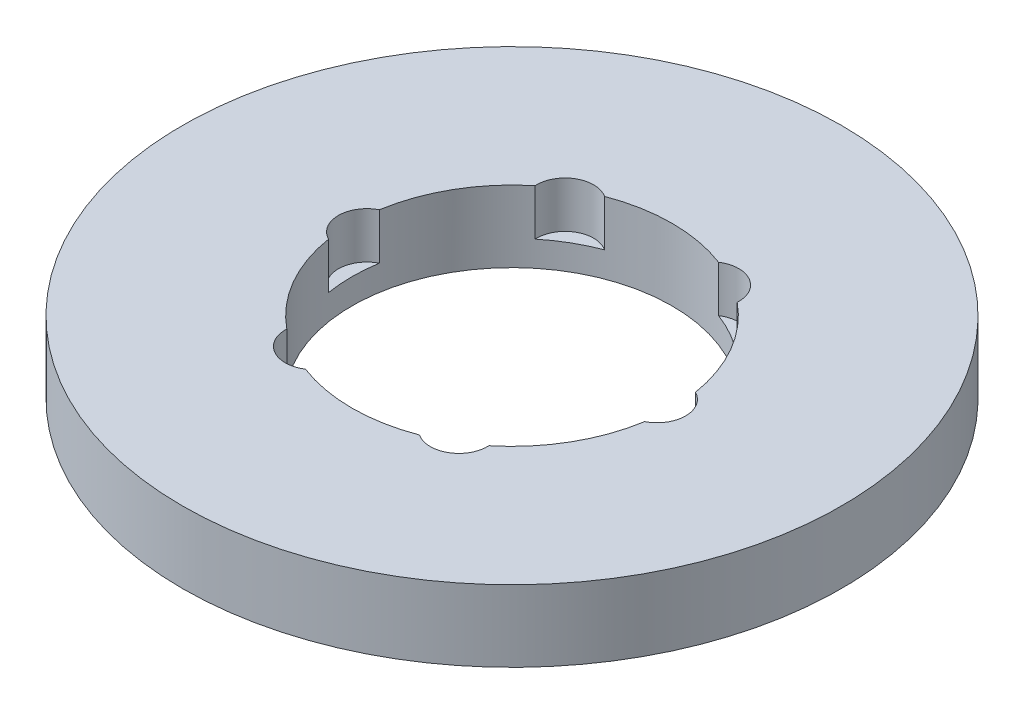
ISO-10303-21;
HEADER;
FILE_DESCRIPTION(('STEP AP214'),'2;1');
FILE_NAME('part.step','',(''),(''),'','','');
FILE_SCHEMA(('AUTOMOTIVE_DESIGN { 1 0 10303 214 1 1 1 1 }'));
ENDSEC;
DATA;
#1=APPLICATION_CONTEXT('core data for automotive mechanical design processes');
#2=APPLICATION_PROTOCOL_DEFINITION('international standard','automotive_design',2000,#1);
#3=PRODUCT_CONTEXT('',#1,'mechanical');
#4=PRODUCT('Part','Part','',(#3));
#5=PRODUCT_RELATED_PRODUCT_CATEGORY('part','',(#4));
#6=PRODUCT_DEFINITION_FORMATION('','',#4);
#7=PRODUCT_DEFINITION_CONTEXT('part definition',#1,'design');
#8=PRODUCT_DEFINITION('design','',#6,#7);
#9=PRODUCT_DEFINITION_SHAPE('','',#8);
#10=(LENGTH_UNIT() NAMED_UNIT(*) SI_UNIT(.MILLI.,.METRE.));
#11=(NAMED_UNIT(*) PLANE_ANGLE_UNIT() SI_UNIT($,.RADIAN.));
#12=(NAMED_UNIT(*) SI_UNIT($,.STERADIAN.) SOLID_ANGLE_UNIT());
#13=UNCERTAINTY_MEASURE_WITH_UNIT(LENGTH_MEASURE(1.E-05),#10,'distance_accuracy_value','');
#14=(GEOMETRIC_REPRESENTATION_CONTEXT(3) GLOBAL_UNCERTAINTY_ASSIGNED_CONTEXT((#13)) GLOBAL_UNIT_ASSIGNED_CONTEXT((#10,
#11,#12)) REPRESENTATION_CONTEXT('',''));
#15=CARTESIAN_POINT('',(0.,0.,0.));
#16=DIRECTION('',(0.,0.,1.));
#17=DIRECTION('',(1.,0.,0.));
#18=AXIS2_PLACEMENT_3D('',#15,#16,#17);
#19=CARTESIAN_POINT('',(0.,19.,0.));
#20=DIRECTION('',(0.,-1.,0.));
#21=DIRECTION('',(0.,0.,-1.));
#22=AXIS2_PLACEMENT_3D('',#19,#20,#21);
#23=CYLINDRICAL_SURFACE('',#22,87.5);
#24=CARTESIAN_POINT('',(0.,19.,0.));
#25=DIRECTION('',(0.,1.,0.));
#26=DIRECTION('',(0.,0.,1.));
#27=AXIS2_PLACEMENT_3D('',#24,#25,#26);
#28=CIRCLE('',#27,87.5);
#29=CARTESIAN_POINT('',(0.,19.,87.5));
#30=VERTEX_POINT('',#29);
#31=EDGE_CURVE('E162',#30,#30,#28,.T.);
#32=ORIENTED_EDGE('',*,*,#31,.F.);
#33=EDGE_LOOP('',(#32));
#34=FACE_BOUND('',#33,.T.);
#35=CARTESIAN_POINT('',(0.,0.,0.));
#36=DIRECTION('',(0.,1.,0.));
#37=DIRECTION('',(0.,0.,1.));
#38=AXIS2_PLACEMENT_3D('',#35,#36,#37);
#39=CIRCLE('',#38,87.5);
#40=CARTESIAN_POINT('',(0.,0.,87.5));
#41=VERTEX_POINT('',#40);
#42=EDGE_CURVE('E157',#41,#41,#39,.T.);
#43=ORIENTED_EDGE('',*,*,#42,.T.);
#44=EDGE_LOOP('',(#43));
#45=FACE_BOUND('',#44,.T.);
#46=ADVANCED_FACE('F39',(#34,#45),#23,.T.);
#47=CARTESIAN_POINT('',(0.,19.,0.));
#48=DIRECTION('',(0.,1.,0.));
#49=DIRECTION('',(0.,0.,1.));
#50=AXIS2_PLACEMENT_3D('',#47,#48,#49);
#51=PLANE('',#50);
#52=CARTESIAN_POINT('',(-19.2661317388735,19.,-33.3699190370433));
#53=DIRECTION('',(0.,1.,0.));
#54=DIRECTION('',(-0.866025403784433,0.,0.50000000000001));
#55=AXIS2_PLACEMENT_3D('',#52,#53,#54);
#56=CIRCLE('',#55,7.5710354546421);
#57=CARTESIAN_POINT('',(-15.1342240727539,19.,-39.714043633401));
#58=VERTEX_POINT('',#57);
#59=CARTESIAN_POINT('',(-26.8262586371527,19.,-32.9636443302708));
#60=VERTEX_POINT('',#59);
#61=EDGE_CURVE('E218',#58,#60,#56,.T.);
#62=ORIENTED_EDGE('',*,*,#61,.F.);
#63=CARTESIAN_POINT('',(0.,19.,0.));
#64=DIRECTION('',(0.,1.,0.));
#65=DIRECTION('',(0.,0.,1.));
#66=AXIS2_PLACEMENT_3D('',#63,#64,#65);
#67=CIRCLE('',#66,42.5);
#68=CARTESIAN_POINT('',(15.1342240727531,19.,-39.7140436334013));
#69=VERTEX_POINT('',#68);
#70=EDGE_CURVE('E169',#69,#58,#67,.T.);
#71=ORIENTED_EDGE('',*,*,#70,.F.);
#72=CARTESIAN_POINT('',(19.2661317388728,19.,-33.3699190370437));
#73=DIRECTION('',(0.,1.,0.));
#74=DIRECTION('',(-0.866025403784443,0.,-0.499999999999992));
#75=AXIS2_PLACEMENT_3D('',#72,#73,#74);
#76=CIRCLE('',#75,7.5710354546421);
#77=CARTESIAN_POINT('',(26.826258637152,19.,-32.9636443302713));
#78=VERTEX_POINT('',#77);
#79=EDGE_CURVE('E285',#78,#69,#76,.T.);
#80=ORIENTED_EDGE('',*,*,#79,.F.);
#81=CARTESIAN_POINT('',(41.9604827099058,19.,-6.75039930313007));
#82=VERTEX_POINT('',#81);
#83=EDGE_CURVE('E174',#82,#78,#67,.T.);
#84=ORIENTED_EDGE('',*,*,#83,.F.);
#85=CARTESIAN_POINT('',(38.5322634777462,19.,0.));
#86=DIRECTION('',(0.,1.,0.));
#87=DIRECTION('',(0.,0.,-1.));
#88=AXIS2_PLACEMENT_3D('',#85,#86,#87);
#89=CIRCLE('',#88,7.5710354546421);
#90=CARTESIAN_POINT('',(41.9604827099058,19.,6.75039930313007));
#91=VERTEX_POINT('',#90);
#92=EDGE_CURVE('E280',#91,#82,#89,.T.);
#93=ORIENTED_EDGE('',*,*,#92,.F.);
#94=CARTESIAN_POINT('',(26.8262586371525,19.,32.963644330271));
#95=VERTEX_POINT('',#94);
#96=EDGE_CURVE('E164',#95,#91,#67,.T.);
#97=ORIENTED_EDGE('',*,*,#96,.F.);
#98=CARTESIAN_POINT('',(19.2661317388733,19.,33.3699190370435));
#99=DIRECTION('',(0.,1.,0.));
#100=DIRECTION('',(0.866025403784436,0.,-0.500000000000004));
#101=AXIS2_PLACEMENT_3D('',#98,#99,#100);
#102=CIRCLE('',#101,7.5710354546421);
#103=CARTESIAN_POINT('',(15.1342240727537,19.,39.7140436334011));
#104=VERTEX_POINT('',#103);
#105=EDGE_CURVE('E269',#104,#95,#102,.T.);
#106=ORIENTED_EDGE('',*,*,#105,.F.);
#107=CARTESIAN_POINT('',(-15.1342240727534,19.,39.7140436334012));
#108=VERTEX_POINT('',#107);
#109=EDGE_CURVE('E149',#108,#104,#67,.T.);
#110=ORIENTED_EDGE('',*,*,#109,.F.);
#111=CARTESIAN_POINT('',(-19.266131738873,19.,33.3699190370436));
#112=DIRECTION('',(0.,1.,0.));
#113=DIRECTION('',(0.86602540378444,0.,0.499999999999998));
#114=AXIS2_PLACEMENT_3D('',#111,#112,#113);
#115=CIRCLE('',#114,7.5710354546421);
#116=CARTESIAN_POINT('',(-26.8262586371522,19.,32.9636443302711));
#117=VERTEX_POINT('',#116);
#118=EDGE_CURVE('E128',#117,#108,#115,.T.);
#119=ORIENTED_EDGE('',*,*,#118,.F.);
#120=CARTESIAN_POINT('',(-41.9604827099058,19.,6.75039930313007));
#121=VERTEX_POINT('',#120);
#122=EDGE_CURVE('E148',#121,#117,#67,.T.);
#123=ORIENTED_EDGE('',*,*,#122,.F.);
#124=CARTESIAN_POINT('',(-38.5322634777462,19.,0.));
#125=DIRECTION('',(0.,1.,0.));
#126=DIRECTION('',(0.,0.,1.));
#127=AXIS2_PLACEMENT_3D('',#124,#125,#126);
#128=CIRCLE('',#127,7.5710354546421);
#129=CARTESIAN_POINT('',(-41.9604827099058,19.,-6.75039930313007));
#130=VERTEX_POINT('',#129);
#131=EDGE_CURVE('E179',#130,#121,#128,.T.);
#132=ORIENTED_EDGE('',*,*,#131,.F.);
#133=EDGE_CURVE('E161',#60,#130,#67,.T.);
#134=ORIENTED_EDGE('',*,*,#133,.F.);
#135=EDGE_LOOP('',(#62,#71,#80,#84,#93,#97,#106,#110,#119,#123,#132,#134));
#136=FACE_BOUND('',#135,.T.);
#137=ORIENTED_EDGE('',*,*,#31,.T.);
#138=EDGE_LOOP('',(#137));
#139=FACE_BOUND('',#138,.T.);
#140=ADVANCED_FACE('F141',(#136,#139),#51,.T.);
#141=CARTESIAN_POINT('',(0.,0.,0.));
#142=DIRECTION('',(0.,1.,0.));
#143=DIRECTION('',(0.,0.,1.));
#144=AXIS2_PLACEMENT_3D('',#141,#142,#143);
#145=PLANE('',#144);
#146=CARTESIAN_POINT('',(0.,0.,0.));
#147=DIRECTION('',(0.,1.,0.));
#148=DIRECTION('',(0.,0.,1.));
#149=AXIS2_PLACEMENT_3D('',#146,#147,#148);
#150=CIRCLE('',#149,42.5);
#151=CARTESIAN_POINT('',(0.,0.,42.5));
#152=VERTEX_POINT('',#151);
#153=EDGE_CURVE('E166',#152,#152,#150,.T.);
#154=ORIENTED_EDGE('',*,*,#153,.T.);
#155=EDGE_LOOP('',(#154));
#156=FACE_BOUND('',#155,.T.);
#157=ORIENTED_EDGE('',*,*,#42,.F.);
#158=EDGE_LOOP('',(#157));
#159=FACE_BOUND('',#158,.T.);
#160=ADVANCED_FACE('F234',(#156,#159),#145,.F.);
#161=CARTESIAN_POINT('',(0.,19.,0.));
#162=DIRECTION('',(0.,-1.,0.));
#163=DIRECTION('',(0.,0.,-1.));
#164=AXIS2_PLACEMENT_3D('',#161,#162,#163);
#165=CYLINDRICAL_SURFACE('',#164,42.5);
#166=DIRECTION('',(0.,1.,0.));
#167=VECTOR('',#166,1.);
#168=CARTESIAN_POINT('',(-15.1342240727539,12.8593762244336,-39.714043633401));
#169=LINE('',#168,#167);
#170=CARTESIAN_POINT('',(-15.1342240727539,6.71875244886714,-39.714043633401));
#171=VERTEX_POINT('',#170);
#172=EDGE_CURVE('E11',#171,#58,#169,.T.);
#173=ORIENTED_EDGE('',*,*,#172,.F.);
#174=CARTESIAN_POINT('',(0.,6.71875244886714,0.));
#175=DIRECTION('',(0.,1.,0.));
#176=DIRECTION('',(0.,0.,1.));
#177=AXIS2_PLACEMENT_3D('',#174,#175,#176);
#178=CIRCLE('',#177,42.5);
#179=CARTESIAN_POINT('',(-26.8262586371527,6.71875244886714,-32.9636443302708));
#180=VERTEX_POINT('',#179);
#181=EDGE_CURVE('E214',#171,#180,#178,.T.);
#182=ORIENTED_EDGE('',*,*,#181,.T.);
#183=DIRECTION('',(0.,1.,0.));
#184=VECTOR('',#183,1.);
#185=CARTESIAN_POINT('',(-26.8262586371527,12.8593762244336,-32.9636443302708));
#186=LINE('',#185,#184);
#187=EDGE_CURVE('E46',#60,#180,#186,.F.);
#188=ORIENTED_EDGE('',*,*,#187,.F.);
#189=ORIENTED_EDGE('',*,*,#133,.T.);
#190=DIRECTION('',(0.,1.,0.));
#191=VECTOR('',#190,1.);
#192=CARTESIAN_POINT('',(-41.9604827099058,12.8593762244336,-6.75039930313007));
#193=LINE('',#192,#191);
#194=CARTESIAN_POINT('',(-41.9604827099058,6.71875244886714,-6.75039930313007));
#195=VERTEX_POINT('',#194);
#196=EDGE_CURVE('E187',#195,#130,#193,.T.);
#197=ORIENTED_EDGE('',*,*,#196,.F.);
#198=CARTESIAN_POINT('',(0.,6.71875244886714,0.));
#199=DIRECTION('',(0.,1.,0.));
#200=DIRECTION('',(0.,0.,1.));
#201=AXIS2_PLACEMENT_3D('',#198,#199,#200);
#202=CIRCLE('',#201,42.5);
#203=CARTESIAN_POINT('',(-41.9604827099058,6.71875244886714,6.75039930313007));
#204=VERTEX_POINT('',#203);
#205=EDGE_CURVE('E184',#195,#204,#202,.T.);
#206=ORIENTED_EDGE('',*,*,#205,.T.);
#207=DIRECTION('',(0.,1.,0.));
#208=VECTOR('',#207,1.);
#209=CARTESIAN_POINT('',(-41.9604827099058,12.8593762244336,6.75039930313007));
#210=LINE('',#209,#208);
#211=EDGE_CURVE('E158',#121,#204,#210,.F.);
#212=ORIENTED_EDGE('',*,*,#211,.F.);
#213=ORIENTED_EDGE('',*,*,#122,.T.);
#214=DIRECTION('',(0.,1.,0.));
#215=VECTOR('',#214,1.);
#216=CARTESIAN_POINT('',(-26.8262586371522,12.8593762244336,32.9636443302711));
#217=LINE('',#216,#215);
#218=CARTESIAN_POINT('',(-26.8262586371522,6.71875244886714,32.9636443302711));
#219=VERTEX_POINT('',#218);
#220=EDGE_CURVE('E127',#219,#117,#217,.T.);
#221=ORIENTED_EDGE('',*,*,#220,.F.);
#222=CARTESIAN_POINT('',(0.,6.71875244886714,0.));
#223=DIRECTION('',(0.,1.,0.));
#224=DIRECTION('',(0.,0.,1.));
#225=AXIS2_PLACEMENT_3D('',#222,#223,#224);
#226=CIRCLE('',#225,42.5);
#227=CARTESIAN_POINT('',(-15.1342240727534,6.71875244886714,39.7140436334012));
#228=VERTEX_POINT('',#227);
#229=EDGE_CURVE('E189',#219,#228,#226,.T.);
#230=ORIENTED_EDGE('',*,*,#229,.T.);
#231=DIRECTION('',(0.,1.,0.));
#232=VECTOR('',#231,1.);
#233=CARTESIAN_POINT('',(-15.1342240727534,12.8593762244336,39.7140436334012));
#234=LINE('',#233,#232);
#235=EDGE_CURVE('E140',#108,#228,#234,.F.);
#236=ORIENTED_EDGE('',*,*,#235,.F.);
#237=ORIENTED_EDGE('',*,*,#109,.T.);
#238=DIRECTION('',(0.,1.,0.));
#239=VECTOR('',#238,1.);
#240=CARTESIAN_POINT('',(15.1342240727537,12.8593762244336,39.7140436334011));
#241=LINE('',#240,#239);
#242=CARTESIAN_POINT('',(15.1342240727537,6.71875244886714,39.7140436334011));
#243=VERTEX_POINT('',#242);
#244=EDGE_CURVE('E196',#243,#104,#241,.T.);
#245=ORIENTED_EDGE('',*,*,#244,.F.);
#246=CARTESIAN_POINT('',(0.,6.71875244886714,0.));
#247=DIRECTION('',(0.,1.,0.));
#248=DIRECTION('',(0.,0.,1.));
#249=AXIS2_PLACEMENT_3D('',#246,#247,#248);
#250=CIRCLE('',#249,42.5);
#251=CARTESIAN_POINT('',(26.8262586371525,6.71875244886714,32.963644330271));
#252=VERTEX_POINT('',#251);
#253=EDGE_CURVE('E136',#243,#252,#250,.T.);
#254=ORIENTED_EDGE('',*,*,#253,.T.);
#255=DIRECTION('',(0.,1.,0.));
#256=VECTOR('',#255,1.);
#257=CARTESIAN_POINT('',(26.8262586371525,12.8593762244336,32.963644330271));
#258=LINE('',#257,#256);
#259=EDGE_CURVE('E194',#95,#252,#258,.F.);
#260=ORIENTED_EDGE('',*,*,#259,.F.);
#261=ORIENTED_EDGE('',*,*,#96,.T.);
#262=DIRECTION('',(0.,1.,0.));
#263=VECTOR('',#262,1.);
#264=CARTESIAN_POINT('',(41.9604827099058,12.8593762244336,6.75039930313007));
#265=LINE('',#264,#263);
#266=CARTESIAN_POINT('',(41.9604827099058,6.71875244886714,6.75039930313007));
#267=VERTEX_POINT('',#266);
#268=EDGE_CURVE('E206',#267,#91,#265,.T.);
#269=ORIENTED_EDGE('',*,*,#268,.F.);
#270=CARTESIAN_POINT('',(0.,6.71875244886714,0.));
#271=DIRECTION('',(0.,1.,0.));
#272=DIRECTION('',(0.,0.,1.));
#273=AXIS2_PLACEMENT_3D('',#270,#271,#272);
#274=CIRCLE('',#273,42.5);
#275=CARTESIAN_POINT('',(41.9604827099058,6.71875244886714,-6.75039930313007));
#276=VERTEX_POINT('',#275);
#277=EDGE_CURVE('E199',#267,#276,#274,.T.);
#278=ORIENTED_EDGE('',*,*,#277,.T.);
#279=DIRECTION('',(0.,1.,0.));
#280=VECTOR('',#279,1.);
#281=CARTESIAN_POINT('',(41.9604827099058,12.8593762244336,-6.75039930313007));
#282=LINE('',#281,#280);
#283=EDGE_CURVE('E201',#82,#276,#282,.F.);
#284=ORIENTED_EDGE('',*,*,#283,.F.);
#285=ORIENTED_EDGE('',*,*,#83,.T.);
#286=DIRECTION('',(0.,1.,0.));
#287=VECTOR('',#286,1.);
#288=CARTESIAN_POINT('',(26.826258637152,12.8593762244336,-32.9636443302713));
#289=LINE('',#288,#287);
#290=CARTESIAN_POINT('',(26.826258637152,6.71875244886714,-32.9636443302713));
#291=VERTEX_POINT('',#290);
#292=EDGE_CURVE('E213',#291,#78,#289,.T.);
#293=ORIENTED_EDGE('',*,*,#292,.F.);
#294=CARTESIAN_POINT('',(0.,6.71875244886714,0.));
#295=DIRECTION('',(0.,1.,0.));
#296=DIRECTION('',(0.,0.,1.));
#297=AXIS2_PLACEMENT_3D('',#294,#295,#296);
#298=CIRCLE('',#297,42.5);
#299=CARTESIAN_POINT('',(15.1342240727531,6.71875244886714,-39.7140436334013));
#300=VERTEX_POINT('',#299);
#301=EDGE_CURVE('E208',#291,#300,#298,.T.);
#302=ORIENTED_EDGE('',*,*,#301,.T.);
#303=DIRECTION('',(0.,1.,0.));
#304=VECTOR('',#303,1.);
#305=CARTESIAN_POINT('',(15.1342240727531,12.8593762244336,-39.7140436334013));
#306=LINE('',#305,#304);
#307=EDGE_CURVE('E211',#69,#300,#306,.F.);
#308=ORIENTED_EDGE('',*,*,#307,.F.);
#309=ORIENTED_EDGE('',*,*,#70,.T.);
#310=EDGE_LOOP('',(#173,#182,#188,#189,#197,#206,#212,#213,#221,#230,#236,#237,#245,#254,#260,
#261,#269,#278,#284,#285,#293,#302,#308,#309));
#311=FACE_BOUND('',#310,.T.);
#312=ORIENTED_EDGE('',*,*,#153,.F.);
#313=EDGE_LOOP('',(#312));
#314=FACE_BOUND('',#313,.T.);
#315=ADVANCED_FACE('F152',(#311,#314),#165,.F.);
#316=CARTESIAN_POINT('',(-38.5322634777462,6.71875244886714,0.));
#317=DIRECTION('',(0.,1.,0.));
#318=DIRECTION('',(0.,0.,1.));
#319=AXIS2_PLACEMENT_3D('',#316,#317,#318);
#320=CYLINDRICAL_SURFACE('',#319,7.5710354546421);
#321=ORIENTED_EDGE('',*,*,#196,.T.);
#322=ORIENTED_EDGE('',*,*,#131,.T.);
#323=ORIENTED_EDGE('',*,*,#211,.T.);
#324=CARTESIAN_POINT('',(-38.5322634777462,6.71875244886714,0.));
#325=DIRECTION('',(0.,1.,0.));
#326=DIRECTION('',(0.,0.,1.));
#327=AXIS2_PLACEMENT_3D('',#324,#325,#326);
#328=CIRCLE('',#327,7.5710354546421);
#329=EDGE_CURVE('E180',#195,#204,#328,.T.);
#330=ORIENTED_EDGE('',*,*,#329,.F.);
#331=EDGE_LOOP('',(#321,#322,#323,#330));
#332=FACE_BOUND('',#331,.T.);
#333=ADVANCED_FACE('F244',(#332),#320,.F.);
#334=CARTESIAN_POINT('',(-38.5322634777462,6.71875244886714,0.));
#335=DIRECTION('',(0.,1.,0.));
#336=DIRECTION('',(0.,0.,1.));
#337=AXIS2_PLACEMENT_3D('',#334,#335,#336);
#338=PLANE('',#337);
#339=ORIENTED_EDGE('',*,*,#329,.T.);
#340=ORIENTED_EDGE('',*,*,#205,.F.);
#341=EDGE_LOOP('',(#339,#340));
#342=FACE_BOUND('',#341,.T.);
#343=ADVANCED_FACE('F248',(#342),#338,.T.);
#344=CARTESIAN_POINT('',(-19.266131738873,6.71875244886714,33.3699190370436));
#345=DIRECTION('',(0.,1.,0.));
#346=DIRECTION('',(0.,0.,1.));
#347=AXIS2_PLACEMENT_3D('',#344,#345,#346);
#348=CYLINDRICAL_SURFACE('',#347,7.5710354546421);
#349=ORIENTED_EDGE('',*,*,#220,.T.);
#350=ORIENTED_EDGE('',*,*,#118,.T.);
#351=ORIENTED_EDGE('',*,*,#235,.T.);
#352=CARTESIAN_POINT('',(-19.266131738873,6.71875244886714,33.3699190370436));
#353=DIRECTION('',(0.,1.,0.));
#354=DIRECTION('',(0.86602540378444,0.,0.499999999999998));
#355=AXIS2_PLACEMENT_3D('',#352,#353,#354);
#356=CIRCLE('',#355,7.5710354546421);
#357=EDGE_CURVE('E135',#219,#228,#356,.T.);
#358=ORIENTED_EDGE('',*,*,#357,.F.);
#359=EDGE_LOOP('',(#349,#350,#351,#358));
#360=FACE_BOUND('',#359,.T.);
#361=ADVANCED_FACE('F126',(#360),#348,.F.);
#362=CARTESIAN_POINT('',(-19.266131738873,6.71875244886714,33.3699190370436));
#363=DIRECTION('',(0.,1.,0.));
#364=DIRECTION('',(0.86602540378444,0.,0.499999999999998));
#365=AXIS2_PLACEMENT_3D('',#362,#363,#364);
#366=PLANE('',#365);
#367=ORIENTED_EDGE('',*,*,#357,.T.);
#368=ORIENTED_EDGE('',*,*,#229,.F.);
#369=EDGE_LOOP('',(#367,#368));
#370=FACE_BOUND('',#369,.T.);
#371=ADVANCED_FACE('F258',(#370),#366,.T.);
#372=CARTESIAN_POINT('',(19.2661317388733,6.71875244886714,33.3699190370435));
#373=DIRECTION('',(0.,1.,0.));
#374=DIRECTION('',(0.,0.,1.));
#375=AXIS2_PLACEMENT_3D('',#372,#373,#374);
#376=CYLINDRICAL_SURFACE('',#375,7.5710354546421);
#377=ORIENTED_EDGE('',*,*,#244,.T.);
#378=ORIENTED_EDGE('',*,*,#105,.T.);
#379=ORIENTED_EDGE('',*,*,#259,.T.);
#380=CARTESIAN_POINT('',(19.2661317388733,6.71875244886714,33.3699190370435));
#381=DIRECTION('',(0.,1.,0.));
#382=DIRECTION('',(0.866025403784436,0.,-0.500000000000004));
#383=AXIS2_PLACEMENT_3D('',#380,#381,#382);
#384=CIRCLE('',#383,7.5710354546421);
#385=EDGE_CURVE('E147',#243,#252,#384,.T.);
#386=ORIENTED_EDGE('',*,*,#385,.F.);
#387=EDGE_LOOP('',(#377,#378,#379,#386));
#388=FACE_BOUND('',#387,.T.);
#389=ADVANCED_FACE('F256',(#388),#376,.F.);
#390=CARTESIAN_POINT('',(19.2661317388733,6.71875244886714,33.3699190370435));
#391=DIRECTION('',(0.,1.,0.));
#392=DIRECTION('',(0.866025403784436,0.,-0.500000000000004));
#393=AXIS2_PLACEMENT_3D('',#390,#391,#392);
#394=PLANE('',#393);
#395=ORIENTED_EDGE('',*,*,#385,.T.);
#396=ORIENTED_EDGE('',*,*,#253,.F.);
#397=EDGE_LOOP('',(#395,#396));
#398=FACE_BOUND('',#397,.T.);
#399=ADVANCED_FACE('F263',(#398),#394,.T.);
#400=CARTESIAN_POINT('',(38.5322634777462,6.71875244886714,0.));
#401=DIRECTION('',(0.,1.,0.));
#402=DIRECTION('',(0.,0.,1.));
#403=AXIS2_PLACEMENT_3D('',#400,#401,#402);
#404=CYLINDRICAL_SURFACE('',#403,7.5710354546421);
#405=ORIENTED_EDGE('',*,*,#268,.T.);
#406=ORIENTED_EDGE('',*,*,#92,.T.);
#407=ORIENTED_EDGE('',*,*,#283,.T.);
#408=CARTESIAN_POINT('',(38.5322634777462,6.71875244886714,0.));
#409=DIRECTION('',(0.,1.,0.));
#410=DIRECTION('',(0.,0.,-1.));
#411=AXIS2_PLACEMENT_3D('',#408,#409,#410);
#412=CIRCLE('',#411,7.5710354546421);
#413=EDGE_CURVE('E273',#267,#276,#412,.T.);
#414=ORIENTED_EDGE('',*,*,#413,.F.);
#415=EDGE_LOOP('',(#405,#406,#407,#414));
#416=FACE_BOUND('',#415,.T.);
#417=ADVANCED_FACE('F297',(#416),#404,.F.);
#418=CARTESIAN_POINT('',(38.5322634777462,6.71875244886714,0.));
#419=DIRECTION('',(0.,1.,0.));
#420=DIRECTION('',(0.,0.,-1.));
#421=AXIS2_PLACEMENT_3D('',#418,#419,#420);
#422=PLANE('',#421);
#423=ORIENTED_EDGE('',*,*,#413,.T.);
#424=ORIENTED_EDGE('',*,*,#277,.F.);
#425=EDGE_LOOP('',(#423,#424));
#426=FACE_BOUND('',#425,.T.);
#427=ADVANCED_FACE('F299',(#426),#422,.T.);
#428=CARTESIAN_POINT('',(19.2661317388728,6.71875244886714,-33.3699190370437));
#429=DIRECTION('',(0.,1.,0.));
#430=DIRECTION('',(0.,0.,1.));
#431=AXIS2_PLACEMENT_3D('',#428,#429,#430);
#432=CYLINDRICAL_SURFACE('',#431,7.5710354546421);
#433=ORIENTED_EDGE('',*,*,#292,.T.);
#434=ORIENTED_EDGE('',*,*,#79,.T.);
#435=ORIENTED_EDGE('',*,*,#307,.T.);
#436=CARTESIAN_POINT('',(19.2661317388728,6.71875244886714,-33.3699190370437));
#437=DIRECTION('',(0.,1.,0.));
#438=DIRECTION('',(-0.866025403784443,0.,-0.499999999999992));
#439=AXIS2_PLACEMENT_3D('',#436,#437,#438);
#440=CIRCLE('',#439,7.5710354546421);
#441=EDGE_CURVE('E56',#291,#300,#440,.T.);
#442=ORIENTED_EDGE('',*,*,#441,.F.);
#443=EDGE_LOOP('',(#433,#434,#435,#442));
#444=FACE_BOUND('',#443,.T.);
#445=ADVANCED_FACE('F292',(#444),#432,.F.);
#446=CARTESIAN_POINT('',(19.2661317388728,6.71875244886714,-33.3699190370437));
#447=DIRECTION('',(0.,1.,0.));
#448=DIRECTION('',(-0.866025403784443,0.,-0.499999999999992));
#449=AXIS2_PLACEMENT_3D('',#446,#447,#448);
#450=PLANE('',#449);
#451=ORIENTED_EDGE('',*,*,#441,.T.);
#452=ORIENTED_EDGE('',*,*,#301,.F.);
#453=EDGE_LOOP('',(#451,#452));
#454=FACE_BOUND('',#453,.T.);
#455=ADVANCED_FACE('F226',(#454),#450,.T.);
#456=CARTESIAN_POINT('',(-19.2661317388735,6.71875244886714,-33.3699190370433));
#457=DIRECTION('',(0.,1.,0.));
#458=DIRECTION('',(0.,0.,1.));
#459=AXIS2_PLACEMENT_3D('',#456,#457,#458);
#460=CYLINDRICAL_SURFACE('',#459,7.5710354546421);
#461=ORIENTED_EDGE('',*,*,#172,.T.);
#462=ORIENTED_EDGE('',*,*,#61,.T.);
#463=ORIENTED_EDGE('',*,*,#187,.T.);
#464=CARTESIAN_POINT('',(-19.2661317388735,6.71875244886714,-33.3699190370433));
#465=DIRECTION('',(0.,1.,0.));
#466=DIRECTION('',(-0.866025403784433,0.,0.50000000000001));
#467=AXIS2_PLACEMENT_3D('',#464,#465,#466);
#468=CIRCLE('',#467,7.5710354546421);
#469=EDGE_CURVE('E55',#171,#180,#468,.T.);
#470=ORIENTED_EDGE('',*,*,#469,.F.);
#471=EDGE_LOOP('',(#461,#462,#463,#470));
#472=FACE_BOUND('',#471,.T.);
#473=ADVANCED_FACE('F217',(#472),#460,.F.);
#474=CARTESIAN_POINT('',(-19.2661317388735,6.71875244886714,-33.3699190370433));
#475=DIRECTION('',(0.,1.,0.));
#476=DIRECTION('',(-0.866025403784433,0.,0.50000000000001));
#477=AXIS2_PLACEMENT_3D('',#474,#475,#476);
#478=PLANE('',#477);
#479=ORIENTED_EDGE('',*,*,#469,.T.);
#480=ORIENTED_EDGE('',*,*,#181,.F.);
#481=EDGE_LOOP('',(#479,#480));
#482=FACE_BOUND('',#481,.T.);
#483=ADVANCED_FACE('F219',(#482),#478,.T.);
#484=CLOSED_SHELL('',(#46,#140,#160,#315,#333,#343,#361,#371,#389,#399,#417,#427,#445,#455,#473,#483));
#485=MANIFOLD_SOLID_BREP('B2',#484);
#486=ADVANCED_BREP_SHAPE_REPRESENTATION('',(#18,#485),#14);
#487=SHAPE_DEFINITION_REPRESENTATION(#9,#486);
ENDSEC;
END-ISO-10303-21;
